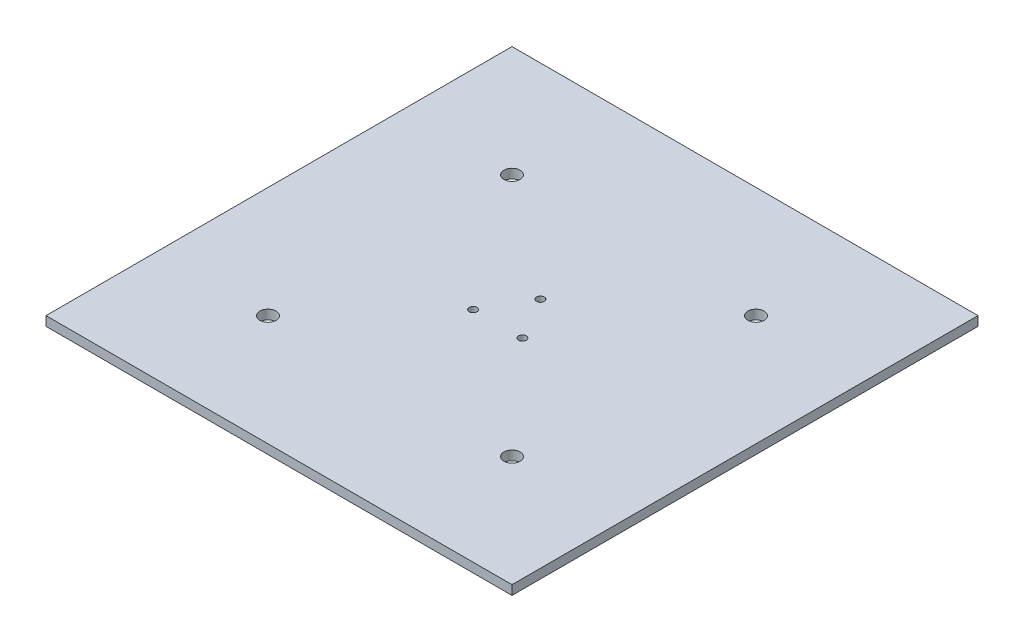
ISO-10303-21;
HEADER;
FILE_DESCRIPTION(('STEP AP214'),'2;1');
FILE_NAME('part.step','',(''),(''),'','','');
FILE_SCHEMA(('AUTOMOTIVE_DESIGN { 1 0 10303 214 1 1 1 1 }'));
ENDSEC;
DATA;
#1=APPLICATION_CONTEXT('core data for automotive mechanical design processes');
#2=APPLICATION_PROTOCOL_DEFINITION('international standard','automotive_design',2000,#1);
#3=PRODUCT_CONTEXT('',#1,'mechanical');
#4=PRODUCT('Part','Part','',(#3));
#5=PRODUCT_RELATED_PRODUCT_CATEGORY('part','',(#4));
#6=PRODUCT_DEFINITION_FORMATION('','',#4);
#7=PRODUCT_DEFINITION_CONTEXT('part definition',#1,'design');
#8=PRODUCT_DEFINITION('design','',#6,#7);
#9=PRODUCT_DEFINITION_SHAPE('','',#8);
#10=(LENGTH_UNIT() NAMED_UNIT(*) SI_UNIT(.MILLI.,.METRE.));
#11=(NAMED_UNIT(*) PLANE_ANGLE_UNIT() SI_UNIT($,.RADIAN.));
#12=(NAMED_UNIT(*) SI_UNIT($,.STERADIAN.) SOLID_ANGLE_UNIT());
#13=UNCERTAINTY_MEASURE_WITH_UNIT(LENGTH_MEASURE(1.E-05),#10,'distance_accuracy_value','');
#14=(GEOMETRIC_REPRESENTATION_CONTEXT(3) GLOBAL_UNCERTAINTY_ASSIGNED_CONTEXT((#13)) GLOBAL_UNIT_ASSIGNED_CONTEXT((#10,
#11,#12)) REPRESENTATION_CONTEXT('',''));
#15=CARTESIAN_POINT('',(0.,0.,0.));
#16=DIRECTION('',(0.,0.,1.));
#17=DIRECTION('',(1.,0.,0.));
#18=AXIS2_PLACEMENT_3D('',#15,#16,#17);
#19=CARTESIAN_POINT('',(127.,5.08,127.));
#20=DIRECTION('',(-1.,0.,0.));
#21=DIRECTION('',(0.,0.,1.));
#22=AXIS2_PLACEMENT_3D('',#19,#20,#21);
#23=PLANE('',#22);
#24=DIRECTION('',(0.,0.,-1.));
#25=VECTOR('',#24,1.);
#26=CARTESIAN_POINT('',(127.,0.,127.));
#27=LINE('',#26,#25);
#28=CARTESIAN_POINT('',(127.,0.,127.));
#29=VERTEX_POINT('',#28);
#30=CARTESIAN_POINT('',(127.,0.,-127.));
#31=VERTEX_POINT('',#30);
#32=EDGE_CURVE('E116',#29,#31,#27,.T.);
#33=ORIENTED_EDGE('',*,*,#32,.T.);
#34=DIRECTION('',(0.,-1.,0.));
#35=VECTOR('',#34,1.);
#36=CARTESIAN_POINT('',(127.,5.08,-127.));
#37=LINE('',#36,#35);
#38=CARTESIAN_POINT('',(127.,5.08,-127.));
#39=VERTEX_POINT('',#38);
#40=EDGE_CURVE('E11',#39,#31,#37,.T.);
#41=ORIENTED_EDGE('',*,*,#40,.F.);
#42=DIRECTION('',(0.,0.,-1.));
#43=VECTOR('',#42,1.);
#44=CARTESIAN_POINT('',(127.,5.08,127.));
#45=LINE('',#44,#43);
#46=CARTESIAN_POINT('',(127.,5.08,127.));
#47=VERTEX_POINT('',#46);
#48=EDGE_CURVE('E99',#47,#39,#45,.T.);
#49=ORIENTED_EDGE('',*,*,#48,.F.);
#50=DIRECTION('',(0.,-1.,0.));
#51=VECTOR('',#50,1.);
#52=CARTESIAN_POINT('',(127.,5.08,127.));
#53=LINE('',#52,#51);
#54=EDGE_CURVE('E112',#47,#29,#53,.T.);
#55=ORIENTED_EDGE('',*,*,#54,.T.);
#56=EDGE_LOOP('',(#33,#41,#49,#55));
#57=FACE_BOUND('',#56,.T.);
#58=ADVANCED_FACE('F47',(#57),#23,.F.);
#59=CARTESIAN_POINT('',(-127.,5.08,-127.));
#60=DIRECTION('',(0.,0.,1.));
#61=DIRECTION('',(1.,0.,0.));
#62=AXIS2_PLACEMENT_3D('',#59,#60,#61);
#63=PLANE('',#62);
#64=DIRECTION('',(-1.,0.,0.));
#65=VECTOR('',#64,1.);
#66=CARTESIAN_POINT('',(-127.,0.,-127.));
#67=LINE('',#66,#65);
#68=CARTESIAN_POINT('',(-127.,0.,-127.));
#69=VERTEX_POINT('',#68);
#70=EDGE_CURVE('E104',#31,#69,#67,.T.);
#71=ORIENTED_EDGE('',*,*,#70,.T.);
#72=DIRECTION('',(0.,-1.,0.));
#73=VECTOR('',#72,1.);
#74=CARTESIAN_POINT('',(-127.,5.08,-127.));
#75=LINE('',#74,#73);
#76=CARTESIAN_POINT('',(-127.,5.08,-127.));
#77=VERTEX_POINT('',#76);
#78=EDGE_CURVE('E56',#77,#69,#75,.T.);
#79=ORIENTED_EDGE('',*,*,#78,.F.);
#80=DIRECTION('',(-1.,0.,0.));
#81=VECTOR('',#80,1.);
#82=CARTESIAN_POINT('',(-127.,5.08,-127.));
#83=LINE('',#82,#81);
#84=EDGE_CURVE('E94',#39,#77,#83,.T.);
#85=ORIENTED_EDGE('',*,*,#84,.F.);
#86=ORIENTED_EDGE('',*,*,#40,.T.);
#87=EDGE_LOOP('',(#71,#79,#85,#86));
#88=FACE_BOUND('',#87,.T.);
#89=ADVANCED_FACE('F103',(#88),#63,.F.);
#90=CARTESIAN_POINT('',(-127.,5.08,127.));
#91=DIRECTION('',(1.,0.,0.));
#92=DIRECTION('',(0.,0.,-1.));
#93=AXIS2_PLACEMENT_3D('',#90,#91,#92);
#94=PLANE('',#93);
#95=DIRECTION('',(0.,0.,1.));
#96=VECTOR('',#95,1.);
#97=CARTESIAN_POINT('',(-127.,0.,127.));
#98=LINE('',#97,#96);
#99=CARTESIAN_POINT('',(-127.,0.,127.));
#100=VERTEX_POINT('',#99);
#101=EDGE_CURVE('E81',#69,#100,#98,.T.);
#102=ORIENTED_EDGE('',*,*,#101,.T.);
#103=DIRECTION('',(0.,-1.,0.));
#104=VECTOR('',#103,1.);
#105=CARTESIAN_POINT('',(-127.,5.08,127.));
#106=LINE('',#105,#104);
#107=CARTESIAN_POINT('',(-127.,5.08,127.));
#108=VERTEX_POINT('',#107);
#109=EDGE_CURVE('E106',#108,#100,#106,.T.);
#110=ORIENTED_EDGE('',*,*,#109,.F.);
#111=DIRECTION('',(0.,0.,1.));
#112=VECTOR('',#111,1.);
#113=CARTESIAN_POINT('',(-127.,5.08,127.));
#114=LINE('',#113,#112);
#115=EDGE_CURVE('E97',#77,#108,#114,.T.);
#116=ORIENTED_EDGE('',*,*,#115,.F.);
#117=ORIENTED_EDGE('',*,*,#78,.T.);
#118=EDGE_LOOP('',(#102,#110,#116,#117));
#119=FACE_BOUND('',#118,.T.);
#120=ADVANCED_FACE('F107',(#119),#94,.F.);
#121=CARTESIAN_POINT('',(-127.,5.08,127.));
#122=DIRECTION('',(0.,0.,-1.));
#123=DIRECTION('',(-1.,0.,0.));
#124=AXIS2_PLACEMENT_3D('',#121,#122,#123);
#125=PLANE('',#124);
#126=DIRECTION('',(1.,0.,0.));
#127=VECTOR('',#126,1.);
#128=CARTESIAN_POINT('',(-127.,0.,127.));
#129=LINE('',#128,#127);
#130=EDGE_CURVE('E87',#100,#29,#129,.T.);
#131=ORIENTED_EDGE('',*,*,#130,.T.);
#132=ORIENTED_EDGE('',*,*,#54,.F.);
#133=DIRECTION('',(1.,0.,0.));
#134=VECTOR('',#133,1.);
#135=CARTESIAN_POINT('',(-127.,5.08,127.));
#136=LINE('',#135,#134);
#137=EDGE_CURVE('E64',#108,#47,#136,.T.);
#138=ORIENTED_EDGE('',*,*,#137,.F.);
#139=ORIENTED_EDGE('',*,*,#109,.T.);
#140=EDGE_LOOP('',(#131,#132,#138,#139));
#141=FACE_BOUND('',#140,.T.);
#142=ADVANCED_FACE('F131',(#141),#125,.F.);
#143=CARTESIAN_POINT('',(0.,5.08,0.));
#144=DIRECTION('',(0.,-1.,0.));
#145=DIRECTION('',(0.,0.,-1.));
#146=AXIS2_PLACEMENT_3D('',#143,#144,#145);
#147=PLANE('',#146);
#148=CARTESIAN_POINT('',(66.5426980126111,5.08,66.5426980126114));
#149=DIRECTION('',(0.,1.,0.));
#150=DIRECTION('',(0.,0.,1.));
#151=AXIS2_PLACEMENT_3D('',#148,#149,#150);
#152=CIRCLE('',#151,4.39999996300001);
#153=CARTESIAN_POINT('',(66.5426980126111,5.08,70.9426979756114));
#154=VERTEX_POINT('',#153);
#155=EDGE_CURVE('E175',#154,#154,#152,.T.);
#156=ORIENTED_EDGE('',*,*,#155,.F.);
#157=EDGE_LOOP('',(#156));
#158=FACE_BOUND('',#157,.T.);
#159=CARTESIAN_POINT('',(-66.4572718999242,5.08,-66.457271899924));
#160=DIRECTION('',(0.,1.,0.));
#161=DIRECTION('',(0.,0.,1.));
#162=AXIS2_PLACEMENT_3D('',#159,#160,#161);
#163=CIRCLE('',#162,4.39999996300001);
#164=CARTESIAN_POINT('',(-66.4572718999242,5.08,-62.057271936924));
#165=VERTEX_POINT('',#164);
#166=EDGE_CURVE('E183',#165,#165,#163,.T.);
#167=ORIENTED_EDGE('',*,*,#166,.F.);
#168=EDGE_LOOP('',(#167));
#169=FACE_BOUND('',#168,.T.);
#170=CARTESIAN_POINT('',(-66.4572718999242,5.08,66.5426980126114));
#171=DIRECTION('',(0.,1.,0.));
#172=DIRECTION('',(0.,0.,1.));
#173=AXIS2_PLACEMENT_3D('',#170,#171,#172);
#174=CIRCLE('',#173,4.39999996300001);
#175=CARTESIAN_POINT('',(-66.4572718999242,5.08,70.9426979756114));
#176=VERTEX_POINT('',#175);
#177=EDGE_CURVE('E167',#176,#176,#174,.T.);
#178=ORIENTED_EDGE('',*,*,#177,.F.);
#179=EDGE_LOOP('',(#178));
#180=FACE_BOUND('',#179,.T.);
#181=CARTESIAN_POINT('',(66.5426980126111,5.08,-66.457271899924));
#182=DIRECTION('',(0.,1.,0.));
#183=DIRECTION('',(0.,0.,1.));
#184=AXIS2_PLACEMENT_3D('',#181,#182,#183);
#185=CIRCLE('',#184,4.39999996300001);
#186=CARTESIAN_POINT('',(66.5426980126111,5.08,-62.057271936924));
#187=VERTEX_POINT('',#186);
#188=EDGE_CURVE('E163',#187,#187,#185,.T.);
#189=ORIENTED_EDGE('',*,*,#188,.F.);
#190=EDGE_LOOP('',(#189));
#191=FACE_BOUND('',#190,.T.);
#192=CARTESIAN_POINT('',(-13.4233669118713,5.08,7.74998450000038));
#193=DIRECTION('',(0.,1.,0.));
#194=DIRECTION('',(0.,0.,1.));
#195=AXIS2_PLACEMENT_3D('',#192,#193,#194);
#196=CIRCLE('',#195,2.10058000000039);
#197=CARTESIAN_POINT('',(-13.4233669118713,5.08,9.85056450000077));
#198=VERTEX_POINT('',#197);
#199=EDGE_CURVE('E156',#198,#198,#196,.T.);
#200=ORIENTED_EDGE('',*,*,#199,.F.);
#201=EDGE_LOOP('',(#200));
#202=FACE_BOUND('',#201,.T.);
#203=CARTESIAN_POINT('',(13.4233669118716,5.08,7.74998450000019));
#204=DIRECTION('',(0.,1.,0.));
#205=DIRECTION('',(0.,0.,1.));
#206=AXIS2_PLACEMENT_3D('',#203,#204,#205);
#207=CIRCLE('',#206,2.10057999999996);
#208=CARTESIAN_POINT('',(13.4233669118716,5.08,9.85056450000015));
#209=VERTEX_POINT('',#208);
#210=EDGE_CURVE('E152',#209,#209,#207,.T.);
#211=ORIENTED_EDGE('',*,*,#210,.F.);
#212=EDGE_LOOP('',(#211));
#213=FACE_BOUND('',#212,.T.);
#214=CARTESIAN_POINT('',(0.,5.08,-15.499969));
#215=DIRECTION('',(0.,1.,0.));
#216=DIRECTION('',(0.,0.,1.));
#217=AXIS2_PLACEMENT_3D('',#214,#215,#216);
#218=CIRCLE('',#217,2.10058);
#219=CARTESIAN_POINT('',(0.,5.08,-13.399389));
#220=VERTEX_POINT('',#219);
#221=EDGE_CURVE('E143',#220,#220,#218,.T.);
#222=ORIENTED_EDGE('',*,*,#221,.F.);
#223=EDGE_LOOP('',(#222));
#224=FACE_BOUND('',#223,.T.);
#225=ORIENTED_EDGE('',*,*,#48,.T.);
#226=ORIENTED_EDGE('',*,*,#84,.T.);
#227=ORIENTED_EDGE('',*,*,#115,.T.);
#228=ORIENTED_EDGE('',*,*,#137,.T.);
#229=EDGE_LOOP('',(#225,#226,#227,#228));
#230=FACE_BOUND('',#229,.T.);
#231=ADVANCED_FACE('F95',(#158,#169,#180,#191,#202,#213,#224,#230),#147,.F.);
#232=CARTESIAN_POINT('',(0.,0.,0.));
#233=DIRECTION('',(0.,-1.,0.));
#234=DIRECTION('',(0.,0.,-1.));
#235=AXIS2_PLACEMENT_3D('',#232,#233,#234);
#236=PLANE('',#235);
#237=CARTESIAN_POINT('',(66.5426980126111,0.,66.5426980126114));
#238=DIRECTION('',(0.,1.,0.));
#239=DIRECTION('',(0.,0.,1.));
#240=AXIS2_PLACEMENT_3D('',#237,#238,#239);
#241=CIRCLE('',#240,4.39999996300001);
#242=CARTESIAN_POINT('',(66.5426980126111,0.,70.9426979756114));
#243=VERTEX_POINT('',#242);
#244=EDGE_CURVE('E171',#243,#243,#241,.T.);
#245=ORIENTED_EDGE('',*,*,#244,.T.);
#246=EDGE_LOOP('',(#245));
#247=FACE_BOUND('',#246,.T.);
#248=CARTESIAN_POINT('',(-66.4572718999242,0.,-66.457271899924));
#249=DIRECTION('',(0.,1.,0.));
#250=DIRECTION('',(0.,0.,1.));
#251=AXIS2_PLACEMENT_3D('',#248,#249,#250);
#252=CIRCLE('',#251,4.39999996300001);
#253=CARTESIAN_POINT('',(-66.4572718999242,0.,-62.057271936924));
#254=VERTEX_POINT('',#253);
#255=EDGE_CURVE('E179',#254,#254,#252,.T.);
#256=ORIENTED_EDGE('',*,*,#255,.T.);
#257=EDGE_LOOP('',(#256));
#258=FACE_BOUND('',#257,.T.);
#259=CARTESIAN_POINT('',(-66.4572718999242,0.,66.5426980126114));
#260=DIRECTION('',(0.,1.,0.));
#261=DIRECTION('',(0.,0.,1.));
#262=AXIS2_PLACEMENT_3D('',#259,#260,#261);
#263=CIRCLE('',#262,4.39999996300001);
#264=CARTESIAN_POINT('',(-66.4572718999242,0.,70.9426979756114));
#265=VERTEX_POINT('',#264);
#266=EDGE_CURVE('E187',#265,#265,#263,.T.);
#267=ORIENTED_EDGE('',*,*,#266,.T.);
#268=EDGE_LOOP('',(#267));
#269=FACE_BOUND('',#268,.T.);
#270=CARTESIAN_POINT('',(66.5426980126111,0.,-66.457271899924));
#271=DIRECTION('',(0.,1.,0.));
#272=DIRECTION('',(0.,0.,1.));
#273=AXIS2_PLACEMENT_3D('',#270,#271,#272);
#274=CIRCLE('',#273,4.39999996300001);
#275=CARTESIAN_POINT('',(66.5426980126111,0.,-62.057271936924));
#276=VERTEX_POINT('',#275);
#277=EDGE_CURVE('E144',#276,#276,#274,.T.);
#278=ORIENTED_EDGE('',*,*,#277,.T.);
#279=EDGE_LOOP('',(#278));
#280=FACE_BOUND('',#279,.T.);
#281=CARTESIAN_POINT('',(-13.4233669118713,0.,7.74998450000038));
#282=DIRECTION('',(0.,1.,0.));
#283=DIRECTION('',(0.,0.,1.));
#284=AXIS2_PLACEMENT_3D('',#281,#282,#283);
#285=CIRCLE('',#284,2.10058000000039);
#286=CARTESIAN_POINT('',(-13.4233669118713,0.,9.85056450000077));
#287=VERTEX_POINT('',#286);
#288=EDGE_CURVE('E120',#287,#287,#285,.T.);
#289=ORIENTED_EDGE('',*,*,#288,.T.);
#290=EDGE_LOOP('',(#289));
#291=FACE_BOUND('',#290,.T.);
#292=CARTESIAN_POINT('',(13.4233669118716,0.,7.74998450000019));
#293=DIRECTION('',(0.,1.,0.));
#294=DIRECTION('',(0.,0.,1.));
#295=AXIS2_PLACEMENT_3D('',#292,#293,#294);
#296=CIRCLE('',#295,2.10057999999996);
#297=CARTESIAN_POINT('',(13.4233669118716,0.,9.85056450000015));
#298=VERTEX_POINT('',#297);
#299=EDGE_CURVE('E148',#298,#298,#296,.T.);
#300=ORIENTED_EDGE('',*,*,#299,.T.);
#301=EDGE_LOOP('',(#300));
#302=FACE_BOUND('',#301,.T.);
#303=CARTESIAN_POINT('',(0.,0.,-15.499969));
#304=DIRECTION('',(0.,1.,0.));
#305=DIRECTION('',(0.,0.,1.));
#306=AXIS2_PLACEMENT_3D('',#303,#304,#305);
#307=CIRCLE('',#306,2.10058);
#308=CARTESIAN_POINT('',(0.,0.,-13.399389));
#309=VERTEX_POINT('',#308);
#310=EDGE_CURVE('E139',#309,#309,#307,.T.);
#311=ORIENTED_EDGE('',*,*,#310,.T.);
#312=EDGE_LOOP('',(#311));
#313=FACE_BOUND('',#312,.T.);
#314=ORIENTED_EDGE('',*,*,#32,.F.);
#315=ORIENTED_EDGE('',*,*,#130,.F.);
#316=ORIENTED_EDGE('',*,*,#101,.F.);
#317=ORIENTED_EDGE('',*,*,#70,.F.);
#318=EDGE_LOOP('',(#314,#315,#316,#317));
#319=FACE_BOUND('',#318,.T.);
#320=ADVANCED_FACE('F134',(#247,#258,#269,#280,#291,#302,#313,#319),#236,.T.);
#321=CARTESIAN_POINT('',(0.,0.,-15.499969));
#322=DIRECTION('',(0.,1.,0.));
#323=DIRECTION('',(0.,0.,1.));
#324=AXIS2_PLACEMENT_3D('',#321,#322,#323);
#325=CYLINDRICAL_SURFACE('',#324,2.10058);
#326=ORIENTED_EDGE('',*,*,#310,.F.);
#327=EDGE_LOOP('',(#326));
#328=FACE_BOUND('',#327,.T.);
#329=ORIENTED_EDGE('',*,*,#221,.T.);
#330=EDGE_LOOP('',(#329));
#331=FACE_BOUND('',#330,.T.);
#332=ADVANCED_FACE('F210',(#328,#331),#325,.F.);
#333=CARTESIAN_POINT('',(13.4233669118716,0.,7.74998450000019));
#334=DIRECTION('',(0.,1.,0.));
#335=DIRECTION('',(0.,0.,1.));
#336=AXIS2_PLACEMENT_3D('',#333,#334,#335);
#337=CYLINDRICAL_SURFACE('',#336,2.10057999999996);
#338=ORIENTED_EDGE('',*,*,#299,.F.);
#339=EDGE_LOOP('',(#338));
#340=FACE_BOUND('',#339,.T.);
#341=ORIENTED_EDGE('',*,*,#210,.T.);
#342=EDGE_LOOP('',(#341));
#343=FACE_BOUND('',#342,.T.);
#344=ADVANCED_FACE('F212',(#340,#343),#337,.F.);
#345=CARTESIAN_POINT('',(-13.4233669118713,0.,7.74998450000038));
#346=DIRECTION('',(0.,1.,0.));
#347=DIRECTION('',(0.,0.,1.));
#348=AXIS2_PLACEMENT_3D('',#345,#346,#347);
#349=CYLINDRICAL_SURFACE('',#348,2.10058000000039);
#350=ORIENTED_EDGE('',*,*,#288,.F.);
#351=EDGE_LOOP('',(#350));
#352=FACE_BOUND('',#351,.T.);
#353=ORIENTED_EDGE('',*,*,#199,.T.);
#354=EDGE_LOOP('',(#353));
#355=FACE_BOUND('',#354,.T.);
#356=ADVANCED_FACE('F219',(#352,#355),#349,.F.);
#357=CARTESIAN_POINT('',(66.5426980126111,0.,-66.457271899924));
#358=DIRECTION('',(0.,1.,0.));
#359=DIRECTION('',(0.,0.,1.));
#360=AXIS2_PLACEMENT_3D('',#357,#358,#359);
#361=CYLINDRICAL_SURFACE('',#360,4.39999996300001);
#362=ORIENTED_EDGE('',*,*,#277,.F.);
#363=EDGE_LOOP('',(#362));
#364=FACE_BOUND('',#363,.T.);
#365=ORIENTED_EDGE('',*,*,#188,.T.);
#366=EDGE_LOOP('',(#365));
#367=FACE_BOUND('',#366,.T.);
#368=ADVANCED_FACE('F279',(#364,#367),#361,.F.);
#369=CARTESIAN_POINT('',(-66.4572718999242,0.,66.5426980126114));
#370=DIRECTION('',(0.,1.,0.));
#371=DIRECTION('',(0.,0.,1.));
#372=AXIS2_PLACEMENT_3D('',#369,#370,#371);
#373=CYLINDRICAL_SURFACE('',#372,4.39999996300001);
#374=ORIENTED_EDGE('',*,*,#266,.F.);
#375=EDGE_LOOP('',(#374));
#376=FACE_BOUND('',#375,.T.);
#377=ORIENTED_EDGE('',*,*,#177,.T.);
#378=EDGE_LOOP('',(#377));
#379=FACE_BOUND('',#378,.T.);
#380=ADVANCED_FACE('F196',(#376,#379),#373,.F.);
#381=CARTESIAN_POINT('',(-66.4572718999242,0.,-66.457271899924));
#382=DIRECTION('',(0.,1.,0.));
#383=DIRECTION('',(0.,0.,1.));
#384=AXIS2_PLACEMENT_3D('',#381,#382,#383);
#385=CYLINDRICAL_SURFACE('',#384,4.39999996300001);
#386=ORIENTED_EDGE('',*,*,#255,.F.);
#387=EDGE_LOOP('',(#386));
#388=FACE_BOUND('',#387,.T.);
#389=ORIENTED_EDGE('',*,*,#166,.T.);
#390=EDGE_LOOP('',(#389));
#391=FACE_BOUND('',#390,.T.);
#392=ADVANCED_FACE('F296',(#388,#391),#385,.F.);
#393=CARTESIAN_POINT('',(66.5426980126111,0.,66.5426980126114));
#394=DIRECTION('',(0.,1.,0.));
#395=DIRECTION('',(0.,0.,1.));
#396=AXIS2_PLACEMENT_3D('',#393,#394,#395);
#397=CYLINDRICAL_SURFACE('',#396,4.39999996300001);
#398=ORIENTED_EDGE('',*,*,#244,.F.);
#399=EDGE_LOOP('',(#398));
#400=FACE_BOUND('',#399,.T.);
#401=ORIENTED_EDGE('',*,*,#155,.T.);
#402=EDGE_LOOP('',(#401));
#403=FACE_BOUND('',#402,.T.);
#404=ADVANCED_FACE('F305',(#400,#403),#397,.F.);
#405=CLOSED_SHELL('',(#58,#89,#120,#142,#231,#320,#332,#344,#356,#368,#380,#392,#404));
#406=MANIFOLD_SOLID_BREP('B2',#405);
#407=ADVANCED_BREP_SHAPE_REPRESENTATION('',(#18,#406),#14);
#408=SHAPE_DEFINITION_REPRESENTATION(#9,#407);
ENDSEC;
END-ISO-10303-21;
